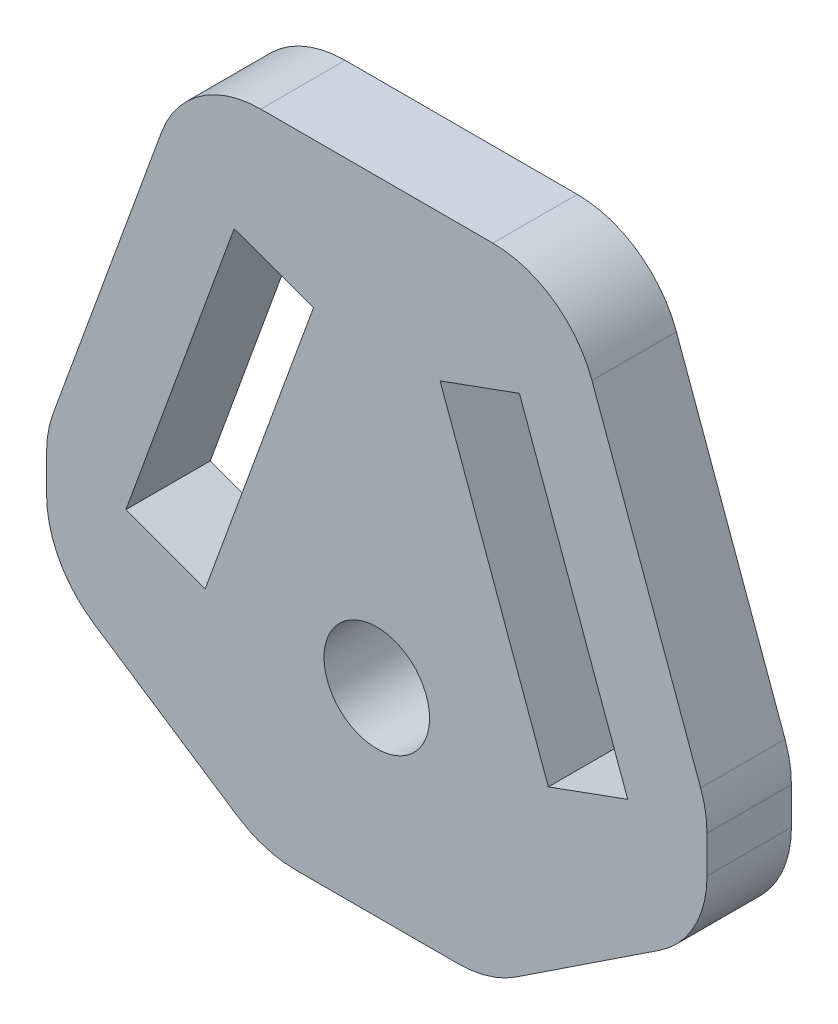
ISO-10303-21;
HEADER;
FILE_DESCRIPTION(('STEP AP214'),'2;1');
FILE_NAME('part.step','',(''),(''),'','','');
FILE_SCHEMA(('AUTOMOTIVE_DESIGN { 1 0 10303 214 1 1 1 1 }'));
ENDSEC;
DATA;
#1=APPLICATION_CONTEXT('core data for automotive mechanical design processes');
#2=APPLICATION_PROTOCOL_DEFINITION('international standard','automotive_design',2000,#1);
#3=PRODUCT_CONTEXT('',#1,'mechanical');
#4=PRODUCT('Part','Part','',(#3));
#5=PRODUCT_RELATED_PRODUCT_CATEGORY('part','',(#4));
#6=PRODUCT_DEFINITION_FORMATION('','',#4);
#7=PRODUCT_DEFINITION_CONTEXT('part definition',#1,'design');
#8=PRODUCT_DEFINITION('design','',#6,#7);
#9=PRODUCT_DEFINITION_SHAPE('','',#8);
#10=(LENGTH_UNIT() NAMED_UNIT(*) SI_UNIT(.MILLI.,.METRE.));
#11=(NAMED_UNIT(*) PLANE_ANGLE_UNIT() SI_UNIT($,.RADIAN.));
#12=(NAMED_UNIT(*) SI_UNIT($,.STERADIAN.) SOLID_ANGLE_UNIT());
#13=UNCERTAINTY_MEASURE_WITH_UNIT(LENGTH_MEASURE(1.E-05),#10,'distance_accuracy_value','');
#14=(GEOMETRIC_REPRESENTATION_CONTEXT(3) GLOBAL_UNCERTAINTY_ASSIGNED_CONTEXT((#13)) GLOBAL_UNIT_ASSIGNED_CONTEXT((#10,
#11,#12)) REPRESENTATION_CONTEXT('',''));
#15=CARTESIAN_POINT('',(0.,0.,0.));
#16=DIRECTION('',(0.,0.,1.));
#17=DIRECTION('',(1.,0.,0.));
#18=AXIS2_PLACEMENT_3D('',#15,#16,#17);
#19=CARTESIAN_POINT('',(-15.6478431161723,0.,4.));
#20=DIRECTION('',(1.,0.,0.));
#21=DIRECTION('',(0.,1.,0.));
#22=AXIS2_PLACEMENT_3D('',#19,#20,#21);
#23=PLANE('',#22);
#24=DIRECTION('',(0.,-1.,0.));
#25=VECTOR('',#24,1.);
#26=CARTESIAN_POINT('',(-15.6478431161723,0.,0.));
#27=LINE('',#26,#25);
#28=CARTESIAN_POINT('',(-15.6478431161723,1.85452624306302,0.));
#29=VERTEX_POINT('',#28);
#30=CARTESIAN_POINT('',(-15.6478431161723,0.103536293679903,0.));
#31=VERTEX_POINT('',#30);
#32=EDGE_CURVE('E316',#29,#31,#27,.T.);
#33=ORIENTED_EDGE('',*,*,#32,.T.);
#34=DIRECTION('',(0.,0.,-1.));
#35=VECTOR('',#34,1.);
#36=CARTESIAN_POINT('',(-15.6478431161723,0.103536293679903,4.));
#37=LINE('',#36,#35);
#38=CARTESIAN_POINT('',(-15.6478431161723,0.103536293679903,4.));
#39=VERTEX_POINT('',#38);
#40=EDGE_CURVE('E404',#31,#39,#37,.F.);
#41=ORIENTED_EDGE('',*,*,#40,.T.);
#42=DIRECTION('',(0.,-1.,0.));
#43=VECTOR('',#42,1.);
#44=CARTESIAN_POINT('',(-15.6478431161723,0.,4.));
#45=LINE('',#44,#43);
#46=CARTESIAN_POINT('',(-15.6478431161723,1.85452624306302,4.));
#47=VERTEX_POINT('',#46);
#48=EDGE_CURVE('E254',#47,#39,#45,.T.);
#49=ORIENTED_EDGE('',*,*,#48,.F.);
#50=DIRECTION('',(0.,0.,-1.));
#51=VECTOR('',#50,1.);
#52=CARTESIAN_POINT('',(-15.6478431161723,1.85452624306302,4.));
#53=LINE('',#52,#51);
#54=EDGE_CURVE('E400',#47,#29,#53,.T.);
#55=ORIENTED_EDGE('',*,*,#54,.T.);
#56=EDGE_LOOP('',(#33,#41,#49,#55));
#57=FACE_BOUND('',#56,.T.);
#58=ADVANCED_FACE('F41',(#57),#23,.F.);
#59=CARTESIAN_POINT('',(-5.94852533064035,-8.9973519745775,4.));
#60=DIRECTION('',(0.551505480193756,0.834171268575138,0.));
#61=DIRECTION('',(-0.834171268575138,0.551505480193756,0.));
#62=AXIS2_PLACEMENT_3D('',#59,#60,#61);
#63=PLANE('',#62);
#64=DIRECTION('',(0.834171268575138,-0.551505480193756,0.));
#65=VECTOR('',#64,1.);
#66=CARTESIAN_POINT('',(-5.94852533064035,-8.9973519745775,4.));
#67=LINE('',#66,#65);
#68=CARTESIAN_POINT('',(-13.4053705171411,-4.06732004919579,4.));
#69=VERTEX_POINT('',#68);
#70=CARTESIAN_POINT('',(-6.59826406234268,-8.56778255073477,4.));
#71=VERTEX_POINT('',#70);
#72=EDGE_CURVE('E258',#69,#71,#67,.T.);
#73=ORIENTED_EDGE('',*,*,#72,.F.);
#74=DIRECTION('',(0.,0.,-1.));
#75=VECTOR('',#74,1.);
#76=CARTESIAN_POINT('',(-13.4053705171411,-4.06732004919579,4.));
#77=LINE('',#76,#75);
#78=CARTESIAN_POINT('',(-13.4053705171411,-4.06732004919579,0.));
#79=VERTEX_POINT('',#78);
#80=EDGE_CURVE('E372',#69,#79,#77,.T.);
#81=ORIENTED_EDGE('',*,*,#80,.T.);
#82=DIRECTION('',(0.834171268575138,-0.551505480193756,0.));
#83=VECTOR('',#82,1.);
#84=CARTESIAN_POINT('',(-5.94852533064035,-8.9973519745775,0.));
#85=LINE('',#84,#83);
#86=CARTESIAN_POINT('',(-6.59826406234268,-8.56778255073477,0.));
#87=VERTEX_POINT('',#86);
#88=EDGE_CURVE('E320',#79,#87,#85,.T.);
#89=ORIENTED_EDGE('',*,*,#88,.T.);
#90=DIRECTION('',(0.,0.,-1.));
#91=VECTOR('',#90,1.);
#92=CARTESIAN_POINT('',(-6.59826406234268,-8.56778255073477,4.));
#93=LINE('',#92,#91);
#94=EDGE_CURVE('E362',#87,#71,#93,.F.);
#95=ORIENTED_EDGE('',*,*,#94,.T.);
#96=EDGE_LOOP('',(#73,#81,#89,#95));
#97=FACE_BOUND('',#96,.T.);
#98=ADVANCED_FACE('F495',(#97),#63,.F.);
#99=CARTESIAN_POINT('',(0.,-9.39692620785908,4.));
#100=DIRECTION('',(0.,1.,0.));
#101=DIRECTION('',(0.,0.,1.));
#102=AXIS2_PLACEMENT_3D('',#99,#100,#101);
#103=PLANE('',#102);
#104=DIRECTION('',(1.,0.,0.));
#105=VECTOR('',#104,1.);
#106=CARTESIAN_POINT('',(0.,-9.39692620785908,4.));
#107=LINE('',#106,#105);
#108=CARTESIAN_POINT('',(-3.8407366613739,-9.39692620785908,4.));
#109=VERTEX_POINT('',#108);
#110=CARTESIAN_POINT('',(3.8407366613739,-9.39692620785908,4.));
#111=VERTEX_POINT('',#110);
#112=EDGE_CURVE('E262',#109,#111,#107,.T.);
#113=ORIENTED_EDGE('',*,*,#112,.F.);
#114=DIRECTION('',(0.,0.,-1.));
#115=VECTOR('',#114,1.);
#116=CARTESIAN_POINT('',(-3.8407366613739,-9.39692620785908,4.));
#117=LINE('',#116,#115);
#118=CARTESIAN_POINT('',(-3.8407366613739,-9.39692620785908,0.));
#119=VERTEX_POINT('',#118);
#120=EDGE_CURVE('E433',#109,#119,#117,.T.);
#121=ORIENTED_EDGE('',*,*,#120,.T.);
#122=DIRECTION('',(1.,0.,0.));
#123=VECTOR('',#122,1.);
#124=CARTESIAN_POINT('',(0.,-9.39692620785908,0.));
#125=LINE('',#124,#123);
#126=CARTESIAN_POINT('',(3.8407366613739,-9.39692620785908,0.));
#127=VERTEX_POINT('',#126);
#128=EDGE_CURVE('E324',#119,#127,#125,.T.);
#129=ORIENTED_EDGE('',*,*,#128,.T.);
#130=DIRECTION('',(0.,0.,-1.));
#131=VECTOR('',#130,1.);
#132=CARTESIAN_POINT('',(3.8407366613739,-9.39692620785908,4.));
#133=LINE('',#132,#131);
#134=EDGE_CURVE('E430',#127,#111,#133,.F.);
#135=ORIENTED_EDGE('',*,*,#134,.T.);
#136=EDGE_LOOP('',(#113,#121,#129,#135));
#137=FACE_BOUND('',#136,.T.);
#138=ADVANCED_FACE('F504',(#137),#103,.F.);
#139=CARTESIAN_POINT('',(5.94852533064035,-8.9973519745775,4.));
#140=DIRECTION('',(0.551505480193756,-0.834171268575138,0.));
#141=DIRECTION('',(0.834171268575138,0.551505480193756,0.));
#142=AXIS2_PLACEMENT_3D('',#139,#140,#141);
#143=PLANE('',#142);
#144=DIRECTION('',(-0.834171268575138,-0.551505480193756,0.));
#145=VECTOR('',#144,1.);
#146=CARTESIAN_POINT('',(5.94852533064035,-8.9973519745775,4.));
#147=LINE('',#146,#145);
#148=CARTESIAN_POINT('',(13.4053705171411,-4.06732004919579,4.));
#149=VERTEX_POINT('',#148);
#150=CARTESIAN_POINT('',(6.59826406234268,-8.56778255073477,4.));
#151=VERTEX_POINT('',#150);
#152=EDGE_CURVE('E266',#149,#151,#147,.T.);
#153=ORIENTED_EDGE('',*,*,#152,.T.);
#154=DIRECTION('',(0.,0.,-1.));
#155=VECTOR('',#154,1.);
#156=CARTESIAN_POINT('',(6.59826406234268,-8.56778255073477,0.));
#157=LINE('',#156,#155);
#158=CARTESIAN_POINT('',(6.59826406234268,-8.56778255073477,0.));
#159=VERTEX_POINT('',#158);
#160=EDGE_CURVE('E440',#151,#159,#157,.T.);
#161=ORIENTED_EDGE('',*,*,#160,.T.);
#162=DIRECTION('',(-0.834171268575138,-0.551505480193756,0.));
#163=VECTOR('',#162,1.);
#164=CARTESIAN_POINT('',(5.94852533064035,-8.9973519745775,0.));
#165=LINE('',#164,#163);
#166=CARTESIAN_POINT('',(13.4053705171411,-4.06732004919579,0.));
#167=VERTEX_POINT('',#166);
#168=EDGE_CURVE('E328',#167,#159,#165,.T.);
#169=ORIENTED_EDGE('',*,*,#168,.F.);
#170=DIRECTION('',(0.,0.,-1.));
#171=VECTOR('',#170,1.);
#172=CARTESIAN_POINT('',(13.4053705171411,-4.06732004919579,4.));
#173=LINE('',#172,#171);
#174=EDGE_CURVE('E437',#167,#149,#173,.F.);
#175=ORIENTED_EDGE('',*,*,#174,.T.);
#176=EDGE_LOOP('',(#153,#161,#169,#175));
#177=FACE_BOUND('',#176,.T.);
#178=ADVANCED_FACE('F512',(#177),#143,.T.);
#179=CARTESIAN_POINT('',(15.6478431161723,0.,4.));
#180=DIRECTION('',(1.,0.,0.));
#181=DIRECTION('',(0.,1.,0.));
#182=AXIS2_PLACEMENT_3D('',#179,#180,#181);
#183=PLANE('',#182);
#184=DIRECTION('',(0.,-1.,0.));
#185=VECTOR('',#184,1.);
#186=CARTESIAN_POINT('',(15.6478431161723,0.,4.));
#187=LINE('',#186,#185);
#188=CARTESIAN_POINT('',(15.6478431161723,1.85452624306303,4.));
#189=VERTEX_POINT('',#188);
#190=CARTESIAN_POINT('',(15.6478431161723,0.103536293679906,4.));
#191=VERTEX_POINT('',#190);
#192=EDGE_CURVE('E270',#189,#191,#187,.T.);
#193=ORIENTED_EDGE('',*,*,#192,.T.);
#194=DIRECTION('',(0.,0.,-1.));
#195=VECTOR('',#194,1.);
#196=CARTESIAN_POINT('',(15.6478431161723,0.103536293679906,4.));
#197=LINE('',#196,#195);
#198=CARTESIAN_POINT('',(15.6478431161723,0.103536293679906,0.));
#199=VERTEX_POINT('',#198);
#200=EDGE_CURVE('E447',#191,#199,#197,.T.);
#201=ORIENTED_EDGE('',*,*,#200,.T.);
#202=DIRECTION('',(0.,-1.,0.));
#203=VECTOR('',#202,1.);
#204=CARTESIAN_POINT('',(15.6478431161723,0.,0.));
#205=LINE('',#204,#203);
#206=CARTESIAN_POINT('',(15.6478431161723,1.85452624306303,0.));
#207=VERTEX_POINT('',#206);
#208=EDGE_CURVE('E332',#207,#199,#205,.T.);
#209=ORIENTED_EDGE('',*,*,#208,.F.);
#210=DIRECTION('',(0.,0.,-1.));
#211=VECTOR('',#210,1.);
#212=CARTESIAN_POINT('',(15.6478431161723,1.85452624306303,4.));
#213=LINE('',#212,#211);
#214=EDGE_CURVE('E444',#207,#189,#213,.F.);
#215=ORIENTED_EDGE('',*,*,#214,.T.);
#216=EDGE_LOOP('',(#193,#201,#209,#215));
#217=FACE_BOUND('',#216,.T.);
#218=ADVANCED_FACE('F522',(#217),#183,.T.);
#219=CARTESIAN_POINT('',(14.6967784326286,5.34918988908233,4.));
#220=DIRECTION('',(0.939692620785908,0.342020143325669,0.));
#221=DIRECTION('',(-0.342020143325669,0.939692620785908,0.));
#222=AXIS2_PLACEMENT_3D('',#219,#220,#221);
#223=PLANE('',#222);
#224=DIRECTION('',(0.342020143325669,-0.939692620785908,0.));
#225=VECTOR('',#224,1.);
#226=CARTESIAN_POINT('',(14.6967784326286,5.34918988908233,4.));
#227=LINE('',#226,#225);
#228=CARTESIAN_POINT('',(10.1977748229831,17.7101007166283,4.));
#229=VERTEX_POINT('',#228);
#230=CARTESIAN_POINT('',(15.3463062201019,3.56462695969137,4.));
#231=VERTEX_POINT('',#230);
#232=EDGE_CURVE('E274',#229,#231,#227,.T.);
#233=ORIENTED_EDGE('',*,*,#232,.T.);
#234=DIRECTION('',(0.,0.,-1.));
#235=VECTOR('',#234,1.);
#236=CARTESIAN_POINT('',(15.3463062201019,3.56462695969137,4.));
#237=LINE('',#236,#235);
#238=CARTESIAN_POINT('',(15.3463062201019,3.56462695969137,0.));
#239=VERTEX_POINT('',#238);
#240=EDGE_CURVE('E454',#231,#239,#237,.T.);
#241=ORIENTED_EDGE('',*,*,#240,.T.);
#242=DIRECTION('',(0.342020143325669,-0.939692620785908,0.));
#243=VECTOR('',#242,1.);
#244=CARTESIAN_POINT('',(14.6967784326286,5.34918988908233,0.));
#245=LINE('',#244,#243);
#246=CARTESIAN_POINT('',(10.1977748229831,17.7101007166283,0.));
#247=VERTEX_POINT('',#246);
#248=EDGE_CURVE('E336',#247,#239,#245,.T.);
#249=ORIENTED_EDGE('',*,*,#248,.F.);
#250=DIRECTION('',(0.,0.,-1.));
#251=VECTOR('',#250,1.);
#252=CARTESIAN_POINT('',(10.1977748229831,17.7101007166283,4.));
#253=LINE('',#252,#251);
#254=EDGE_CURVE('E451',#247,#229,#253,.F.);
#255=ORIENTED_EDGE('',*,*,#254,.T.);
#256=EDGE_LOOP('',(#233,#241,#249,#255));
#257=FACE_BOUND('',#256,.T.);
#258=ADVANCED_FACE('F529',(#257),#223,.T.);
#259=CARTESIAN_POINT('',(0.,21.,4.));
#260=DIRECTION('',(0.,1.,0.));
#261=DIRECTION('',(0.,0.,1.));
#262=AXIS2_PLACEMENT_3D('',#259,#260,#261);
#263=PLANE('',#262);
#264=DIRECTION('',(1.,0.,0.));
#265=VECTOR('',#264,1.);
#266=CARTESIAN_POINT('',(0.,21.,0.));
#267=LINE('',#266,#265);
#268=CARTESIAN_POINT('',(-5.49931171905354,21.,0.));
#269=VERTEX_POINT('',#268);
#270=CARTESIAN_POINT('',(5.49931171905354,21.,0.));
#271=VERTEX_POINT('',#270);
#272=EDGE_CURVE('E340',#269,#271,#267,.T.);
#273=ORIENTED_EDGE('',*,*,#272,.F.);
#274=DIRECTION('',(0.,0.,-1.));
#275=VECTOR('',#274,1.);
#276=CARTESIAN_POINT('',(-5.49931171905354,21.,4.));
#277=LINE('',#276,#275);
#278=CARTESIAN_POINT('',(-5.49931171905354,21.,4.));
#279=VERTEX_POINT('',#278);
#280=EDGE_CURVE('E11',#269,#279,#277,.F.);
#281=ORIENTED_EDGE('',*,*,#280,.T.);
#282=DIRECTION('',(1.,0.,0.));
#283=VECTOR('',#282,1.);
#284=CARTESIAN_POINT('',(0.,21.,4.));
#285=LINE('',#284,#283);
#286=CARTESIAN_POINT('',(5.49931171905354,21.,4.));
#287=VERTEX_POINT('',#286);
#288=EDGE_CURVE('E278',#279,#287,#285,.T.);
#289=ORIENTED_EDGE('',*,*,#288,.T.);
#290=DIRECTION('',(0.,0.,-1.));
#291=VECTOR('',#290,1.);
#292=CARTESIAN_POINT('',(5.49931171905354,21.,4.));
#293=LINE('',#292,#291);
#294=EDGE_CURVE('E50',#287,#271,#293,.T.);
#295=ORIENTED_EDGE('',*,*,#294,.T.);
#296=EDGE_LOOP('',(#273,#281,#289,#295));
#297=FACE_BOUND('',#296,.T.);
#298=ADVANCED_FACE('F468',(#297),#263,.T.);
#299=CARTESIAN_POINT('',(-4.17923746634137,11.4823605693116,4.));
#300=DIRECTION('',(-0.342020143325669,0.939692620785908,0.));
#301=DIRECTION('',(-0.939692620785908,-0.342020143325669,0.));
#302=AXIS2_PLACEMENT_3D('',#299,#300,#301);
#303=PLANE('',#302);
#304=DIRECTION('',(0.939692620785908,0.342020143325669,0.));
#305=VECTOR('',#304,1.);
#306=CARTESIAN_POINT('',(-4.17923746634137,11.4823605693116,0.));
#307=LINE('',#306,#305);
#308=CARTESIAN_POINT('',(3.00000000000001,14.0953893117886,0.));
#309=VERTEX_POINT('',#308);
#310=CARTESIAN_POINT('',(6.75877048314364,15.4634698850913,0.));
#311=VERTEX_POINT('',#310);
#312=EDGE_CURVE('E303',#309,#311,#307,.T.);
#313=ORIENTED_EDGE('',*,*,#312,.T.);
#314=DIRECTION('',(0.,0.,-1.));
#315=VECTOR('',#314,1.);
#316=CARTESIAN_POINT('',(6.75877048314364,15.4634698850913,4.));
#317=LINE('',#316,#315);
#318=CARTESIAN_POINT('',(6.75877048314364,15.4634698850913,4.));
#319=VERTEX_POINT('',#318);
#320=EDGE_CURVE('E358',#319,#311,#317,.T.);
#321=ORIENTED_EDGE('',*,*,#320,.F.);
#322=DIRECTION('',(0.939692620785908,0.342020143325669,0.));
#323=VECTOR('',#322,1.);
#324=CARTESIAN_POINT('',(-4.17923746634137,11.4823605693116,4.));
#325=LINE('',#324,#323);
#326=CARTESIAN_POINT('',(3.00000000000001,14.0953893117886,4.));
#327=VERTEX_POINT('',#326);
#328=EDGE_CURVE('E241',#327,#319,#325,.T.);
#329=ORIENTED_EDGE('',*,*,#328,.F.);
#330=DIRECTION('',(0.,0.,-1.));
#331=VECTOR('',#330,1.);
#332=CARTESIAN_POINT('',(3.00000000000001,14.0953893117886,4.));
#333=LINE('',#332,#331);
#334=EDGE_CURVE('E216',#327,#309,#333,.T.);
#335=ORIENTED_EDGE('',*,*,#334,.T.);
#336=EDGE_LOOP('',(#313,#321,#329,#335));
#337=FACE_BOUND('',#336,.T.);
#338=ADVANCED_FACE('F557',(#337),#303,.F.);
#339=CARTESIAN_POINT('',(10.938007949485,3.98110931577965,4.));
#340=DIRECTION('',(0.939692620785908,0.342020143325669,0.));
#341=DIRECTION('',(-0.342020143325669,0.939692620785908,0.));
#342=AXIS2_PLACEMENT_3D('',#339,#340,#341);
#343=PLANE('',#342);
#344=DIRECTION('',(0.342020143325669,-0.939692620785908,0.));
#345=VECTOR('',#344,1.);
#346=CARTESIAN_POINT('',(10.938007949485,3.98110931577965,0.));
#347=LINE('',#346,#345);
#348=CARTESIAN_POINT('',(11.8890726330287,1.36808057330268,0.));
#349=VERTEX_POINT('',#348);
#350=EDGE_CURVE('E307',#311,#349,#347,.T.);
#351=ORIENTED_EDGE('',*,*,#350,.T.);
#352=DIRECTION('',(0.,0.,-1.));
#353=VECTOR('',#352,1.);
#354=CARTESIAN_POINT('',(11.8890726330287,1.36808057330268,4.));
#355=LINE('',#354,#353);
#356=CARTESIAN_POINT('',(11.8890726330287,1.36808057330268,4.));
#357=VERTEX_POINT('',#356);
#358=EDGE_CURVE('E354',#357,#349,#355,.T.);
#359=ORIENTED_EDGE('',*,*,#358,.F.);
#360=DIRECTION('',(0.342020143325669,-0.939692620785908,0.));
#361=VECTOR('',#360,1.);
#362=CARTESIAN_POINT('',(10.938007949485,3.98110931577965,4.));
#363=LINE('',#362,#361);
#364=EDGE_CURVE('E245',#319,#357,#363,.T.);
#365=ORIENTED_EDGE('',*,*,#364,.F.);
#366=ORIENTED_EDGE('',*,*,#320,.T.);
#367=EDGE_LOOP('',(#351,#359,#365,#366));
#368=FACE_BOUND('',#367,.T.);
#369=ADVANCED_FACE('F553',(#368),#343,.F.);
#370=CARTESIAN_POINT('',(0.951064683543669,-2.61302874247698,4.));
#371=DIRECTION('',(0.34202014332567,-0.939692620785908,0.));
#372=DIRECTION('',(0.939692620785908,0.34202014332567,0.));
#373=AXIS2_PLACEMENT_3D('',#370,#371,#372);
#374=PLANE('',#373);
#375=DIRECTION('',(-0.939692620785908,-0.34202014332567,0.));
#376=VECTOR('',#375,1.);
#377=CARTESIAN_POINT('',(0.951064683543669,-2.61302874247698,0.));
#378=LINE('',#377,#376);
#379=CARTESIAN_POINT('',(8.13030214988505,0.,0.));
#380=VERTEX_POINT('',#379);
#381=EDGE_CURVE('E310',#349,#380,#378,.T.);
#382=ORIENTED_EDGE('',*,*,#381,.T.);
#383=DIRECTION('',(0.,0.,-1.));
#384=VECTOR('',#383,1.);
#385=CARTESIAN_POINT('',(8.13030214988505,0.,4.));
#386=LINE('',#385,#384);
#387=CARTESIAN_POINT('',(8.13030214988505,0.,4.));
#388=VERTEX_POINT('',#387);
#389=EDGE_CURVE('E350',#388,#380,#386,.T.);
#390=ORIENTED_EDGE('',*,*,#389,.F.);
#391=DIRECTION('',(-0.939692620785908,-0.34202014332567,0.));
#392=VECTOR('',#391,1.);
#393=CARTESIAN_POINT('',(0.951064683543669,-2.61302874247698,4.));
#394=LINE('',#393,#392);
#395=EDGE_CURVE('E248',#357,#388,#394,.T.);
#396=ORIENTED_EDGE('',*,*,#395,.F.);
#397=ORIENTED_EDGE('',*,*,#358,.T.);
#398=EDGE_LOOP('',(#382,#390,#396,#397));
#399=FACE_BOUND('',#398,.T.);
#400=ADVANCED_FACE('F550',(#399),#374,.F.);
#401=CARTESIAN_POINT('',(4.17923746634137,11.4823605693116,4.));
#402=DIRECTION('',(-0.342020143325669,-0.939692620785908,0.));
#403=DIRECTION('',(0.939692620785908,-0.342020143325669,0.));
#404=AXIS2_PLACEMENT_3D('',#401,#402,#403);
#405=PLANE('',#404);
#406=DIRECTION('',(-0.939692620785908,0.342020143325669,0.));
#407=VECTOR('',#406,1.);
#408=CARTESIAN_POINT('',(4.17923746634137,11.4823605693116,0.));
#409=LINE('',#408,#407);
#410=CARTESIAN_POINT('',(-3.00000000000001,14.0953893117886,0.));
#411=VERTEX_POINT('',#410);
#412=CARTESIAN_POINT('',(-6.75877048314364,15.4634698850913,0.));
#413=VERTEX_POINT('',#412);
#414=EDGE_CURVE('E210',#411,#413,#409,.T.);
#415=ORIENTED_EDGE('',*,*,#414,.F.);
#416=DIRECTION('',(0.,0.,-1.));
#417=VECTOR('',#416,1.);
#418=CARTESIAN_POINT('',(-3.00000000000001,14.0953893117886,4.));
#419=LINE('',#418,#417);
#420=CARTESIAN_POINT('',(-3.00000000000001,14.0953893117886,4.));
#421=VERTEX_POINT('',#420);
#422=EDGE_CURVE('E204',#421,#411,#419,.T.);
#423=ORIENTED_EDGE('',*,*,#422,.F.);
#424=DIRECTION('',(-0.939692620785908,0.342020143325669,0.));
#425=VECTOR('',#424,1.);
#426=CARTESIAN_POINT('',(4.17923746634137,11.4823605693116,4.));
#427=LINE('',#426,#425);
#428=CARTESIAN_POINT('',(-6.75877048314364,15.4634698850913,4.));
#429=VERTEX_POINT('',#428);
#430=EDGE_CURVE('E207',#421,#429,#427,.T.);
#431=ORIENTED_EDGE('',*,*,#430,.T.);
#432=DIRECTION('',(0.,0.,-1.));
#433=VECTOR('',#432,1.);
#434=CARTESIAN_POINT('',(-6.75877048314364,15.4634698850913,4.));
#435=LINE('',#434,#433);
#436=EDGE_CURVE('E285',#429,#413,#435,.T.);
#437=ORIENTED_EDGE('',*,*,#436,.T.);
#438=EDGE_LOOP('',(#415,#423,#431,#437));
#439=FACE_BOUND('',#438,.T.);
#440=ADVANCED_FACE('F206',(#439),#405,.T.);
#441=CARTESIAN_POINT('',(-7.17923746634138,2.61302874247697,4.));
#442=DIRECTION('',(-0.939692620785908,0.342020143325669,0.));
#443=DIRECTION('',(-0.342020143325669,-0.939692620785908,0.));
#444=AXIS2_PLACEMENT_3D('',#441,#442,#443);
#445=PLANE('',#444);
#446=DIRECTION('',(0.342020143325669,0.939692620785908,0.));
#447=VECTOR('',#446,1.);
#448=CARTESIAN_POINT('',(-7.17923746634138,2.61302874247697,0.));
#449=LINE('',#448,#447);
#450=CARTESIAN_POINT('',(-8.13030214988505,0.,0.));
#451=VERTEX_POINT('',#450);
#452=EDGE_CURVE('E292',#451,#411,#449,.T.);
#453=ORIENTED_EDGE('',*,*,#452,.F.);
#454=DIRECTION('',(0.,0.,-1.));
#455=VECTOR('',#454,1.);
#456=CARTESIAN_POINT('',(-8.13030214988505,0.,4.));
#457=LINE('',#456,#455);
#458=CARTESIAN_POINT('',(-8.13030214988505,0.,4.));
#459=VERTEX_POINT('',#458);
#460=EDGE_CURVE('E217',#459,#451,#457,.T.);
#461=ORIENTED_EDGE('',*,*,#460,.F.);
#462=DIRECTION('',(0.342020143325669,0.939692620785908,0.));
#463=VECTOR('',#462,1.);
#464=CARTESIAN_POINT('',(-7.17923746634138,2.61302874247697,4.));
#465=LINE('',#464,#463);
#466=EDGE_CURVE('E224',#459,#421,#465,.T.);
#467=ORIENTED_EDGE('',*,*,#466,.T.);
#468=ORIENTED_EDGE('',*,*,#422,.T.);
#469=EDGE_LOOP('',(#453,#461,#467,#468));
#470=FACE_BOUND('',#469,.T.);
#471=ADVANCED_FACE('F231',(#470),#445,.T.);
#472=CARTESIAN_POINT('',(-0.951064683543669,-2.61302874247698,4.));
#473=DIRECTION('',(0.34202014332567,0.939692620785908,0.));
#474=DIRECTION('',(-0.939692620785908,0.34202014332567,0.));
#475=AXIS2_PLACEMENT_3D('',#472,#473,#474);
#476=PLANE('',#475);
#477=DIRECTION('',(0.939692620785908,-0.34202014332567,0.));
#478=VECTOR('',#477,1.);
#479=CARTESIAN_POINT('',(-0.951064683543669,-2.61302874247698,0.));
#480=LINE('',#479,#478);
#481=CARTESIAN_POINT('',(-11.8890726330287,1.36808057330268,0.));
#482=VERTEX_POINT('',#481);
#483=EDGE_CURVE('E295',#482,#451,#480,.T.);
#484=ORIENTED_EDGE('',*,*,#483,.F.);
#485=DIRECTION('',(0.,0.,-1.));
#486=VECTOR('',#485,1.);
#487=CARTESIAN_POINT('',(-11.8890726330287,1.36808057330268,4.));
#488=LINE('',#487,#486);
#489=CARTESIAN_POINT('',(-11.8890726330287,1.36808057330268,4.));
#490=VERTEX_POINT('',#489);
#491=EDGE_CURVE('E365',#490,#482,#488,.T.);
#492=ORIENTED_EDGE('',*,*,#491,.F.);
#493=DIRECTION('',(0.939692620785908,-0.34202014332567,0.));
#494=VECTOR('',#493,1.);
#495=CARTESIAN_POINT('',(-0.951064683543669,-2.61302874247698,4.));
#496=LINE('',#495,#494);
#497=EDGE_CURVE('E233',#490,#459,#496,.T.);
#498=ORIENTED_EDGE('',*,*,#497,.T.);
#499=ORIENTED_EDGE('',*,*,#460,.T.);
#500=EDGE_LOOP('',(#484,#492,#498,#499));
#501=FACE_BOUND('',#500,.T.);
#502=ADVANCED_FACE('F548',(#501),#476,.T.);
#503=CARTESIAN_POINT('',(7.17923746634138,2.61302874247697,4.));
#504=DIRECTION('',(-0.939692620785908,-0.342020143325669,0.));
#505=DIRECTION('',(0.342020143325669,-0.939692620785908,0.));
#506=AXIS2_PLACEMENT_3D('',#503,#504,#505);
#507=PLANE('',#506);
#508=DIRECTION('',(-0.342020143325669,0.939692620785908,0.));
#509=VECTOR('',#508,1.);
#510=CARTESIAN_POINT('',(7.17923746634138,2.61302874247697,0.));
#511=LINE('',#510,#509);
#512=EDGE_CURVE('E313',#380,#309,#511,.T.);
#513=ORIENTED_EDGE('',*,*,#512,.T.);
#514=ORIENTED_EDGE('',*,*,#334,.F.);
#515=DIRECTION('',(-0.342020143325669,0.939692620785908,0.));
#516=VECTOR('',#515,1.);
#517=CARTESIAN_POINT('',(7.17923746634138,2.61302874247697,4.));
#518=LINE('',#517,#516);
#519=EDGE_CURVE('E251',#388,#327,#518,.T.);
#520=ORIENTED_EDGE('',*,*,#519,.F.);
#521=ORIENTED_EDGE('',*,*,#389,.T.);
#522=EDGE_LOOP('',(#513,#514,#520,#521));
#523=FACE_BOUND('',#522,.T.);
#524=ADVANCED_FACE('F544',(#523),#507,.F.);
#525=CARTESIAN_POINT('',(-10.938007949485,3.98110931577965,4.));
#526=DIRECTION('',(0.939692620785908,-0.342020143325669,0.));
#527=DIRECTION('',(0.342020143325669,0.939692620785908,0.));
#528=AXIS2_PLACEMENT_3D('',#525,#526,#527);
#529=PLANE('',#528);
#530=DIRECTION('',(-0.342020143325669,-0.939692620785908,0.));
#531=VECTOR('',#530,1.);
#532=CARTESIAN_POINT('',(-10.938007949485,3.98110931577965,0.));
#533=LINE('',#532,#531);
#534=EDGE_CURVE('E299',#413,#482,#533,.T.);
#535=ORIENTED_EDGE('',*,*,#534,.F.);
#536=ORIENTED_EDGE('',*,*,#436,.F.);
#537=DIRECTION('',(-0.342020143325669,-0.939692620785908,0.));
#538=VECTOR('',#537,1.);
#539=CARTESIAN_POINT('',(-10.938007949485,3.98110931577965,4.));
#540=LINE('',#539,#538);
#541=EDGE_CURVE('E227',#429,#490,#540,.T.);
#542=ORIENTED_EDGE('',*,*,#541,.T.);
#543=ORIENTED_EDGE('',*,*,#491,.T.);
#544=EDGE_LOOP('',(#535,#536,#542,#543));
#545=FACE_BOUND('',#544,.T.);
#546=ADVANCED_FACE('F547',(#545),#529,.T.);
#547=CARTESIAN_POINT('',(0.,0.,4.));
#548=DIRECTION('',(0.,0.,-1.));
#549=DIRECTION('',(-1.,0.,0.));
#550=AXIS2_PLACEMENT_3D('',#547,#548,#549);
#551=CYLINDRICAL_SURFACE('',#550,2.5);
#552=CARTESIAN_POINT('',(0.,0.,4.));
#553=DIRECTION('',(0.,0.,1.));
#554=DIRECTION('',(1.,0.,0.));
#555=AXIS2_PLACEMENT_3D('',#552,#553,#554);
#556=CIRCLE('',#555,2.5);
#557=CARTESIAN_POINT('',(2.5,0.,4.));
#558=VERTEX_POINT('',#557);
#559=EDGE_CURVE('E229',#558,#558,#556,.T.);
#560=ORIENTED_EDGE('',*,*,#559,.T.);
#561=EDGE_LOOP('',(#560));
#562=FACE_BOUND('',#561,.T.);
#563=CARTESIAN_POINT('',(0.,0.,0.));
#564=DIRECTION('',(0.,0.,1.));
#565=DIRECTION('',(1.,0.,0.));
#566=AXIS2_PLACEMENT_3D('',#563,#564,#565);
#567=CIRCLE('',#566,2.5);
#568=CARTESIAN_POINT('',(2.5,0.,0.));
#569=VERTEX_POINT('',#568);
#570=EDGE_CURVE('E286',#569,#569,#567,.T.);
#571=ORIENTED_EDGE('',*,*,#570,.F.);
#572=EDGE_LOOP('',(#571));
#573=FACE_BOUND('',#572,.T.);
#574=ADVANCED_FACE('F564',(#562,#573),#551,.F.);
#575=CARTESIAN_POINT('',(-14.6967784326286,5.34918988908233,4.));
#576=DIRECTION('',(0.939692620785908,-0.342020143325669,0.));
#577=DIRECTION('',(0.342020143325669,0.939692620785908,0.));
#578=AXIS2_PLACEMENT_3D('',#575,#576,#577);
#579=PLANE('',#578);
#580=DIRECTION('',(-0.342020143325669,-0.939692620785908,0.));
#581=VECTOR('',#580,1.);
#582=CARTESIAN_POINT('',(-14.6967784326286,5.34918988908233,0.));
#583=LINE('',#582,#581);
#584=CARTESIAN_POINT('',(-10.1977748229831,17.7101007166283,0.));
#585=VERTEX_POINT('',#584);
#586=CARTESIAN_POINT('',(-15.3463062201019,3.56462695969137,0.));
#587=VERTEX_POINT('',#586);
#588=EDGE_CURVE('E344',#585,#587,#583,.T.);
#589=ORIENTED_EDGE('',*,*,#588,.T.);
#590=DIRECTION('',(0.,0.,-1.));
#591=VECTOR('',#590,1.);
#592=CARTESIAN_POINT('',(-15.3463062201019,3.56462695969137,4.));
#593=LINE('',#592,#591);
#594=CARTESIAN_POINT('',(-15.3463062201019,3.56462695969137,4.));
#595=VERTEX_POINT('',#594);
#596=EDGE_CURVE('E57',#587,#595,#593,.F.);
#597=ORIENTED_EDGE('',*,*,#596,.T.);
#598=DIRECTION('',(-0.342020143325669,-0.939692620785908,0.));
#599=VECTOR('',#598,1.);
#600=CARTESIAN_POINT('',(-14.6967784326286,5.34918988908233,4.));
#601=LINE('',#600,#599);
#602=CARTESIAN_POINT('',(-10.1977748229831,17.7101007166283,4.));
#603=VERTEX_POINT('',#602);
#604=EDGE_CURVE('E282',#603,#595,#601,.T.);
#605=ORIENTED_EDGE('',*,*,#604,.F.);
#606=DIRECTION('',(0.,0.,-1.));
#607=VECTOR('',#606,1.);
#608=CARTESIAN_POINT('',(-10.1977748229831,17.7101007166283,0.));
#609=LINE('',#608,#607);
#610=EDGE_CURVE('E458',#603,#585,#609,.T.);
#611=ORIENTED_EDGE('',*,*,#610,.T.);
#612=EDGE_LOOP('',(#589,#597,#605,#611));
#613=FACE_BOUND('',#612,.T.);
#614=ADVANCED_FACE('F480',(#613),#579,.F.);
#615=CARTESIAN_POINT('',(0.,0.,4.));
#616=DIRECTION('',(0.,0.,1.));
#617=DIRECTION('',(1.,0.,0.));
#618=AXIS2_PLACEMENT_3D('',#615,#616,#617);
#619=PLANE('',#618);
#620=ORIENTED_EDGE('',*,*,#559,.F.);
#621=EDGE_LOOP('',(#620));
#622=FACE_BOUND('',#621,.T.);
#623=ORIENTED_EDGE('',*,*,#430,.F.);
#624=ORIENTED_EDGE('',*,*,#466,.F.);
#625=ORIENTED_EDGE('',*,*,#497,.F.);
#626=ORIENTED_EDGE('',*,*,#541,.F.);
#627=EDGE_LOOP('',(#623,#624,#625,#626));
#628=FACE_BOUND('',#627,.T.);
#629=ORIENTED_EDGE('',*,*,#328,.T.);
#630=ORIENTED_EDGE('',*,*,#364,.T.);
#631=ORIENTED_EDGE('',*,*,#395,.T.);
#632=ORIENTED_EDGE('',*,*,#519,.T.);
#633=EDGE_LOOP('',(#629,#630,#631,#632));
#634=FACE_BOUND('',#633,.T.);
#635=ORIENTED_EDGE('',*,*,#48,.T.);
#636=CARTESIAN_POINT('',(-10.6478431161723,0.103536293679905,4.));
#637=DIRECTION('',(0.,0.,1.));
#638=DIRECTION('',(1.,0.,0.));
#639=AXIS2_PLACEMENT_3D('',#636,#637,#638);
#640=CIRCLE('',#639,5.);
#641=EDGE_CURVE('E427',#39,#69,#640,.T.);
#642=ORIENTED_EDGE('',*,*,#641,.T.);
#643=ORIENTED_EDGE('',*,*,#72,.T.);
#644=CARTESIAN_POINT('',(-3.8407366613739,-4.39692620785908,4.));
#645=DIRECTION('',(0.,0.,1.));
#646=DIRECTION('',(1.,0.,0.));
#647=AXIS2_PLACEMENT_3D('',#644,#645,#646);
#648=CIRCLE('',#647,5.);
#649=EDGE_CURVE('E424',#71,#109,#648,.T.);
#650=ORIENTED_EDGE('',*,*,#649,.T.);
#651=ORIENTED_EDGE('',*,*,#112,.T.);
#652=CARTESIAN_POINT('',(3.8407366613739,-4.39692620785908,4.));
#653=DIRECTION('',(0.,0.,1.));
#654=DIRECTION('',(1.,0.,0.));
#655=AXIS2_PLACEMENT_3D('',#652,#653,#654);
#656=CIRCLE('',#655,5.);
#657=EDGE_CURVE('E421',#111,#151,#656,.T.);
#658=ORIENTED_EDGE('',*,*,#657,.T.);
#659=ORIENTED_EDGE('',*,*,#152,.F.);
#660=CARTESIAN_POINT('',(10.6478431161723,0.103536293679905,4.));
#661=DIRECTION('',(0.,0.,1.));
#662=DIRECTION('',(1.,0.,0.));
#663=AXIS2_PLACEMENT_3D('',#660,#661,#662);
#664=CIRCLE('',#663,5.);
#665=EDGE_CURVE('E418',#149,#191,#664,.T.);
#666=ORIENTED_EDGE('',*,*,#665,.T.);
#667=ORIENTED_EDGE('',*,*,#192,.F.);
#668=CARTESIAN_POINT('',(10.6478431161723,1.85452624306302,4.));
#669=DIRECTION('',(0.,0.,1.));
#670=DIRECTION('',(1.,0.,0.));
#671=AXIS2_PLACEMENT_3D('',#668,#669,#670);
#672=CIRCLE('',#671,5.);
#673=EDGE_CURVE('E415',#189,#231,#672,.T.);
#674=ORIENTED_EDGE('',*,*,#673,.T.);
#675=ORIENTED_EDGE('',*,*,#232,.F.);
#676=CARTESIAN_POINT('',(5.49931171905354,16.,4.));
#677=DIRECTION('',(0.,0.,1.));
#678=DIRECTION('',(1.,0.,0.));
#679=AXIS2_PLACEMENT_3D('',#676,#677,#678);
#680=CIRCLE('',#679,5.);
#681=EDGE_CURVE('E407',#229,#287,#680,.T.);
#682=ORIENTED_EDGE('',*,*,#681,.T.);
#683=ORIENTED_EDGE('',*,*,#288,.F.);
#684=CARTESIAN_POINT('',(-5.49931171905354,16.,4.));
#685=DIRECTION('',(0.,0.,1.));
#686=DIRECTION('',(1.,0.,0.));
#687=AXIS2_PLACEMENT_3D('',#684,#685,#686);
#688=CIRCLE('',#687,5.);
#689=EDGE_CURVE('E64',#279,#603,#688,.T.);
#690=ORIENTED_EDGE('',*,*,#689,.T.);
#691=ORIENTED_EDGE('',*,*,#604,.T.);
#692=CARTESIAN_POINT('',(-10.6478431161723,1.85452624306302,4.));
#693=DIRECTION('',(0.,0.,1.));
#694=DIRECTION('',(1.,0.,0.));
#695=AXIS2_PLACEMENT_3D('',#692,#693,#694);
#696=CIRCLE('',#695,5.);
#697=EDGE_CURVE('E412',#595,#47,#696,.T.);
#698=ORIENTED_EDGE('',*,*,#697,.T.);
#699=EDGE_LOOP('',(#635,#642,#643,#650,#651,#658,#659,#666,#667,#674,#675,#682,#683,#690,#691,#698));
#700=FACE_BOUND('',#699,.T.);
#701=ADVANCED_FACE('F221',(#622,#628,#634,#700),#619,.T.);
#702=CARTESIAN_POINT('',(0.,0.,0.));
#703=DIRECTION('',(0.,0.,1.));
#704=DIRECTION('',(1.,0.,0.));
#705=AXIS2_PLACEMENT_3D('',#702,#703,#704);
#706=PLANE('',#705);
#707=ORIENTED_EDGE('',*,*,#570,.T.);
#708=EDGE_LOOP('',(#707));
#709=FACE_BOUND('',#708,.T.);
#710=ORIENTED_EDGE('',*,*,#414,.T.);
#711=ORIENTED_EDGE('',*,*,#534,.T.);
#712=ORIENTED_EDGE('',*,*,#483,.T.);
#713=ORIENTED_EDGE('',*,*,#452,.T.);
#714=EDGE_LOOP('',(#710,#711,#712,#713));
#715=FACE_BOUND('',#714,.T.);
#716=ORIENTED_EDGE('',*,*,#312,.F.);
#717=ORIENTED_EDGE('',*,*,#512,.F.);
#718=ORIENTED_EDGE('',*,*,#381,.F.);
#719=ORIENTED_EDGE('',*,*,#350,.F.);
#720=EDGE_LOOP('',(#716,#717,#718,#719));
#721=FACE_BOUND('',#720,.T.);
#722=ORIENTED_EDGE('',*,*,#88,.F.);
#723=CARTESIAN_POINT('',(-10.6478431161723,0.103536293679905,0.));
#724=DIRECTION('',(0.,0.,1.));
#725=DIRECTION('',(1.,0.,0.));
#726=AXIS2_PLACEMENT_3D('',#723,#724,#725);
#727=CIRCLE('',#726,5.);
#728=EDGE_CURVE('E397',#79,#31,#727,.F.);
#729=ORIENTED_EDGE('',*,*,#728,.T.);
#730=ORIENTED_EDGE('',*,*,#32,.F.);
#731=CARTESIAN_POINT('',(-10.6478431161723,1.85452624306302,0.));
#732=DIRECTION('',(0.,0.,1.));
#733=DIRECTION('',(1.,0.,0.));
#734=AXIS2_PLACEMENT_3D('',#731,#732,#733);
#735=CIRCLE('',#734,5.);
#736=EDGE_CURVE('E382',#29,#587,#735,.F.);
#737=ORIENTED_EDGE('',*,*,#736,.T.);
#738=ORIENTED_EDGE('',*,*,#588,.F.);
#739=CARTESIAN_POINT('',(-5.49931171905354,16.,0.));
#740=DIRECTION('',(0.,0.,1.));
#741=DIRECTION('',(1.,0.,0.));
#742=AXIS2_PLACEMENT_3D('',#739,#740,#741);
#743=CIRCLE('',#742,5.);
#744=EDGE_CURVE('E379',#585,#269,#743,.F.);
#745=ORIENTED_EDGE('',*,*,#744,.T.);
#746=ORIENTED_EDGE('',*,*,#272,.T.);
#747=CARTESIAN_POINT('',(5.49931171905354,16.,0.));
#748=DIRECTION('',(0.,0.,1.));
#749=DIRECTION('',(1.,0.,0.));
#750=AXIS2_PLACEMENT_3D('',#747,#748,#749);
#751=CIRCLE('',#750,5.);
#752=EDGE_CURVE('E376',#271,#247,#751,.F.);
#753=ORIENTED_EDGE('',*,*,#752,.T.);
#754=ORIENTED_EDGE('',*,*,#248,.T.);
#755=CARTESIAN_POINT('',(10.6478431161723,1.85452624306302,0.));
#756=DIRECTION('',(0.,0.,1.));
#757=DIRECTION('',(1.,0.,0.));
#758=AXIS2_PLACEMENT_3D('',#755,#756,#757);
#759=CIRCLE('',#758,5.);
#760=EDGE_CURVE('E385',#239,#207,#759,.F.);
#761=ORIENTED_EDGE('',*,*,#760,.T.);
#762=ORIENTED_EDGE('',*,*,#208,.T.);
#763=CARTESIAN_POINT('',(10.6478431161723,0.103536293679905,0.));
#764=DIRECTION('',(0.,0.,1.));
#765=DIRECTION('',(1.,0.,0.));
#766=AXIS2_PLACEMENT_3D('',#763,#764,#765);
#767=CIRCLE('',#766,5.);
#768=EDGE_CURVE('E388',#199,#167,#767,.F.);
#769=ORIENTED_EDGE('',*,*,#768,.T.);
#770=ORIENTED_EDGE('',*,*,#168,.T.);
#771=CARTESIAN_POINT('',(3.8407366613739,-4.39692620785908,0.));
#772=DIRECTION('',(0.,0.,1.));
#773=DIRECTION('',(1.,0.,0.));
#774=AXIS2_PLACEMENT_3D('',#771,#772,#773);
#775=CIRCLE('',#774,5.);
#776=EDGE_CURVE('E391',#159,#127,#775,.F.);
#777=ORIENTED_EDGE('',*,*,#776,.T.);
#778=ORIENTED_EDGE('',*,*,#128,.F.);
#779=CARTESIAN_POINT('',(-3.8407366613739,-4.39692620785908,0.));
#780=DIRECTION('',(0.,0.,1.));
#781=DIRECTION('',(1.,0.,0.));
#782=AXIS2_PLACEMENT_3D('',#779,#780,#781);
#783=CIRCLE('',#782,5.);
#784=EDGE_CURVE('E394',#119,#87,#783,.F.);
#785=ORIENTED_EDGE('',*,*,#784,.T.);
#786=EDGE_LOOP('',(#722,#729,#730,#737,#738,#745,#746,#753,#754,#761,#762,#769,#770,#777,#778,#785));
#787=FACE_BOUND('',#786,.T.);
#788=ADVANCED_FACE('F474',(#709,#715,#721,#787),#706,.F.);
#789=CARTESIAN_POINT('',(-10.6478431161723,0.103536293679905,4.));
#790=DIRECTION('',(0.,0.,-1.));
#791=DIRECTION('',(-1.,0.,0.));
#792=AXIS2_PLACEMENT_3D('',#789,#790,#791);
#793=CYLINDRICAL_SURFACE('',#792,5.);
#794=ORIENTED_EDGE('',*,*,#641,.F.);
#795=ORIENTED_EDGE('',*,*,#40,.F.);
#796=ORIENTED_EDGE('',*,*,#728,.F.);
#797=ORIENTED_EDGE('',*,*,#80,.F.);
#798=EDGE_LOOP('',(#794,#795,#796,#797));
#799=FACE_BOUND('',#798,.T.);
#800=ADVANCED_FACE('F492',(#799),#793,.T.);
#801=CARTESIAN_POINT('',(-3.8407366613739,-4.39692620785908,4.));
#802=DIRECTION('',(0.,0.,-1.));
#803=DIRECTION('',(-1.,0.,0.));
#804=AXIS2_PLACEMENT_3D('',#801,#802,#803);
#805=CYLINDRICAL_SURFACE('',#804,5.);
#806=ORIENTED_EDGE('',*,*,#649,.F.);
#807=ORIENTED_EDGE('',*,*,#94,.F.);
#808=ORIENTED_EDGE('',*,*,#784,.F.);
#809=ORIENTED_EDGE('',*,*,#120,.F.);
#810=EDGE_LOOP('',(#806,#807,#808,#809));
#811=FACE_BOUND('',#810,.T.);
#812=ADVANCED_FACE('F501',(#811),#805,.T.);
#813=CARTESIAN_POINT('',(3.8407366613739,-4.39692620785908,4.));
#814=DIRECTION('',(0.,0.,1.));
#815=DIRECTION('',(1.,0.,0.));
#816=AXIS2_PLACEMENT_3D('',#813,#814,#815);
#817=CYLINDRICAL_SURFACE('',#816,5.);
#818=ORIENTED_EDGE('',*,*,#657,.F.);
#819=ORIENTED_EDGE('',*,*,#134,.F.);
#820=ORIENTED_EDGE('',*,*,#776,.F.);
#821=ORIENTED_EDGE('',*,*,#160,.F.);
#822=EDGE_LOOP('',(#818,#819,#820,#821));
#823=FACE_BOUND('',#822,.T.);
#824=ADVANCED_FACE('F510',(#823),#817,.T.);
#825=CARTESIAN_POINT('',(10.6478431161723,0.103536293679905,4.));
#826=DIRECTION('',(0.,0.,-1.));
#827=DIRECTION('',(-1.,0.,0.));
#828=AXIS2_PLACEMENT_3D('',#825,#826,#827);
#829=CYLINDRICAL_SURFACE('',#828,5.);
#830=ORIENTED_EDGE('',*,*,#665,.F.);
#831=ORIENTED_EDGE('',*,*,#174,.F.);
#832=ORIENTED_EDGE('',*,*,#768,.F.);
#833=ORIENTED_EDGE('',*,*,#200,.F.);
#834=EDGE_LOOP('',(#830,#831,#832,#833));
#835=FACE_BOUND('',#834,.T.);
#836=ADVANCED_FACE('F519',(#835),#829,.T.);
#837=CARTESIAN_POINT('',(10.6478431161723,1.85452624306302,4.));
#838=DIRECTION('',(0.,0.,-1.));
#839=DIRECTION('',(-1.,0.,0.));
#840=AXIS2_PLACEMENT_3D('',#837,#838,#839);
#841=CYLINDRICAL_SURFACE('',#840,5.);
#842=ORIENTED_EDGE('',*,*,#673,.F.);
#843=ORIENTED_EDGE('',*,*,#214,.F.);
#844=ORIENTED_EDGE('',*,*,#760,.F.);
#845=ORIENTED_EDGE('',*,*,#240,.F.);
#846=EDGE_LOOP('',(#842,#843,#844,#845));
#847=FACE_BOUND('',#846,.T.);
#848=ADVANCED_FACE('F527',(#847),#841,.T.);
#849=CARTESIAN_POINT('',(-10.6478431161723,1.85452624306302,4.));
#850=DIRECTION('',(0.,0.,-1.));
#851=DIRECTION('',(-1.,0.,0.));
#852=AXIS2_PLACEMENT_3D('',#849,#850,#851);
#853=CYLINDRICAL_SURFACE('',#852,5.);
#854=ORIENTED_EDGE('',*,*,#697,.F.);
#855=ORIENTED_EDGE('',*,*,#596,.F.);
#856=ORIENTED_EDGE('',*,*,#736,.F.);
#857=ORIENTED_EDGE('',*,*,#54,.F.);
#858=EDGE_LOOP('',(#854,#855,#856,#857));
#859=FACE_BOUND('',#858,.T.);
#860=ADVANCED_FACE('F485',(#859),#853,.T.);
#861=CARTESIAN_POINT('',(-5.49931171905354,16.,4.));
#862=DIRECTION('',(0.,0.,1.));
#863=DIRECTION('',(1.,0.,0.));
#864=AXIS2_PLACEMENT_3D('',#861,#862,#863);
#865=CYLINDRICAL_SURFACE('',#864,5.);
#866=ORIENTED_EDGE('',*,*,#689,.F.);
#867=ORIENTED_EDGE('',*,*,#280,.F.);
#868=ORIENTED_EDGE('',*,*,#744,.F.);
#869=ORIENTED_EDGE('',*,*,#610,.F.);
#870=EDGE_LOOP('',(#866,#867,#868,#869));
#871=FACE_BOUND('',#870,.T.);
#872=ADVANCED_FACE('F479',(#871),#865,.T.);
#873=CARTESIAN_POINT('',(5.49931171905354,16.,4.));
#874=DIRECTION('',(0.,0.,-1.));
#875=DIRECTION('',(-1.,0.,0.));
#876=AXIS2_PLACEMENT_3D('',#873,#874,#875);
#877=CYLINDRICAL_SURFACE('',#876,5.);
#878=ORIENTED_EDGE('',*,*,#681,.F.);
#879=ORIENTED_EDGE('',*,*,#254,.F.);
#880=ORIENTED_EDGE('',*,*,#752,.F.);
#881=ORIENTED_EDGE('',*,*,#294,.F.);
#882=EDGE_LOOP('',(#878,#879,#880,#881));
#883=FACE_BOUND('',#882,.T.);
#884=ADVANCED_FACE('F43',(#883),#877,.T.);
#885=CLOSED_SHELL('',(#58,#98,#138,#178,#218,#258,#298,#338,#369,#400,#440,#471,#502,#524,#546,
#574,#614,#701,#788,#800,#812,#824,#836,#848,#860,#872,#884));
#886=MANIFOLD_SOLID_BREP('B2',#885);
#887=ADVANCED_BREP_SHAPE_REPRESENTATION('',(#18,#886),#14);
#888=SHAPE_DEFINITION_REPRESENTATION(#9,#887);
ENDSEC;
END-ISO-10303-21;
